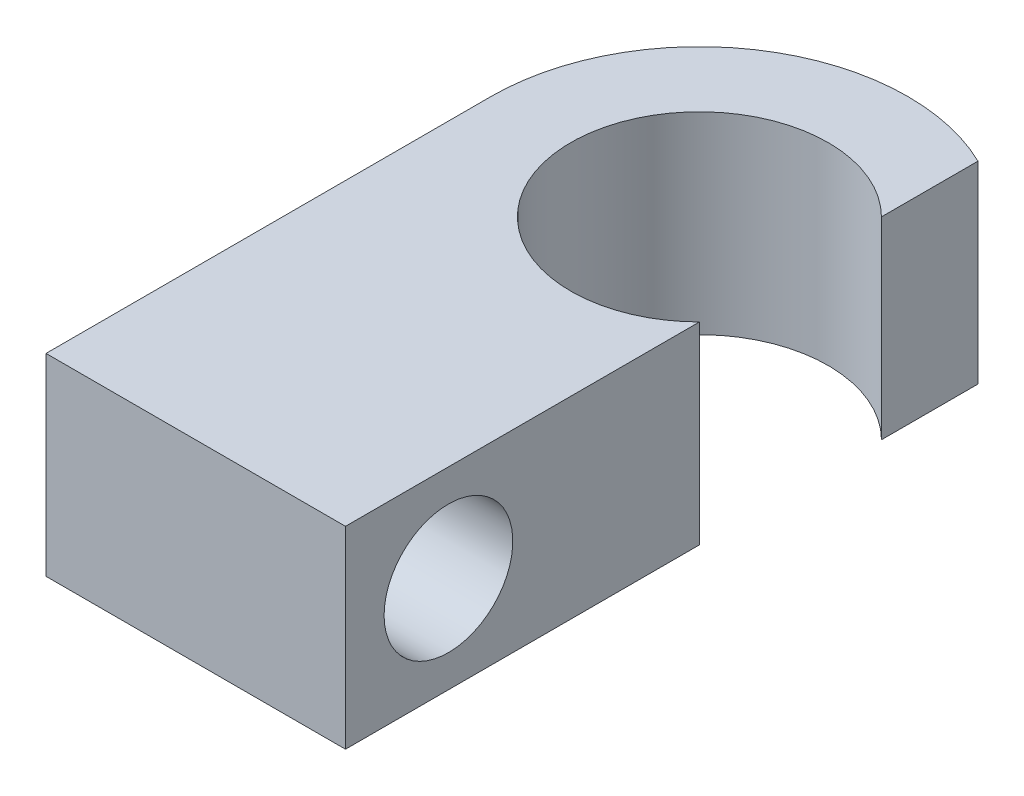
ISO-10303-21;
HEADER;
FILE_DESCRIPTION(('STEP AP214'),'2;1');
FILE_NAME('part.step','',(''),(''),'','','');
FILE_SCHEMA(('AUTOMOTIVE_DESIGN { 1 0 10303 214 1 1 1 1 }'));
ENDSEC;
DATA;
#1=APPLICATION_CONTEXT('core data for automotive mechanical design processes');
#2=APPLICATION_PROTOCOL_DEFINITION('international standard','automotive_design',2000,#1);
#3=PRODUCT_CONTEXT('',#1,'mechanical');
#4=PRODUCT('Part','Part','',(#3));
#5=PRODUCT_RELATED_PRODUCT_CATEGORY('part','',(#4));
#6=PRODUCT_DEFINITION_FORMATION('','',#4);
#7=PRODUCT_DEFINITION_CONTEXT('part definition',#1,'design');
#8=PRODUCT_DEFINITION('design','',#6,#7);
#9=PRODUCT_DEFINITION_SHAPE('','',#8);
#10=(LENGTH_UNIT() NAMED_UNIT(*) SI_UNIT(.MILLI.,.METRE.));
#11=(NAMED_UNIT(*) PLANE_ANGLE_UNIT() SI_UNIT($,.RADIAN.));
#12=(NAMED_UNIT(*) SI_UNIT($,.STERADIAN.) SOLID_ANGLE_UNIT());
#13=UNCERTAINTY_MEASURE_WITH_UNIT(LENGTH_MEASURE(1.E-05),#10,'distance_accuracy_value','');
#14=(GEOMETRIC_REPRESENTATION_CONTEXT(3) GLOBAL_UNCERTAINTY_ASSIGNED_CONTEXT((#13)) GLOBAL_UNIT_ASSIGNED_CONTEXT((#10,
#11,#12)) REPRESENTATION_CONTEXT('',''));
#15=CARTESIAN_POINT('',(0.,0.,0.));
#16=DIRECTION('',(0.,0.,1.));
#17=DIRECTION('',(1.,0.,0.));
#18=AXIS2_PLACEMENT_3D('',#15,#16,#17);
#19=CARTESIAN_POINT('',(0.,9.525,0.));
#20=DIRECTION('',(0.,-1.,0.));
#21=DIRECTION('',(0.,0.,-1.));
#22=AXIS2_PLACEMENT_3D('',#19,#20,#21);
#23=CYLINDRICAL_SURFACE('',#22,10.2845698026992);
#24=DIRECTION('',(0.,1.,0.));
#25=VECTOR('',#24,1.);
#26=CARTESIAN_POINT('',(-10.2845698026992,0.,0.));
#27=LINE('',#26,#25);
#28=CARTESIAN_POINT('',(-10.2845698026992,0.,0.));
#29=VERTEX_POINT('',#28);
#30=CARTESIAN_POINT('',(-10.2845698026992,9.525,0.));
#31=VERTEX_POINT('',#30);
#32=EDGE_CURVE('E45',#29,#31,#27,.T.);
#33=ORIENTED_EDGE('',*,*,#32,.T.);
#34=CARTESIAN_POINT('',(0.,9.525,0.));
#35=DIRECTION('',(0.,1.,0.));
#36=DIRECTION('',(0.,0.,1.));
#37=AXIS2_PLACEMENT_3D('',#34,#35,#36);
#38=CIRCLE('',#37,10.2845698026992);
#39=CARTESIAN_POINT('',(4.49012806053457,9.525,-9.25262806053458));
#40=VERTEX_POINT('',#39);
#41=EDGE_CURVE('E116',#40,#31,#38,.T.);
#42=ORIENTED_EDGE('',*,*,#41,.F.);
#43=DIRECTION('',(0.,-1.,0.));
#44=VECTOR('',#43,1.);
#45=CARTESIAN_POINT('',(4.49012806053457,9.525,-9.25262806053458));
#46=LINE('',#45,#44);
#47=CARTESIAN_POINT('',(4.49012806053457,0.,-9.25262806053458));
#48=VERTEX_POINT('',#47);
#49=EDGE_CURVE('E125',#40,#48,#46,.T.);
#50=ORIENTED_EDGE('',*,*,#49,.T.);
#51=CARTESIAN_POINT('',(0.,0.,0.));
#52=DIRECTION('',(0.,1.,0.));
#53=DIRECTION('',(0.,0.,1.));
#54=AXIS2_PLACEMENT_3D('',#51,#52,#53);
#55=CIRCLE('',#54,10.2845698026992);
#56=EDGE_CURVE('E50',#48,#29,#55,.T.);
#57=ORIENTED_EDGE('',*,*,#56,.T.);
#58=EDGE_LOOP('',(#33,#42,#50,#57));
#59=FACE_BOUND('',#58,.T.);
#60=ADVANCED_FACE('F31',(#59),#23,.T.);
#61=CARTESIAN_POINT('',(4.49012806053457,9.525,4.49012806053458));
#62=DIRECTION('',(-1.,0.,0.));
#63=DIRECTION('',(0.,0.,1.));
#64=AXIS2_PLACEMENT_3D('',#61,#62,#63);
#65=PLANE('',#64);
#66=CARTESIAN_POINT('',(4.49012806053458,4.7625,16.8726280605346));
#67=DIRECTION('',(-1.,0.,0.));
#68=DIRECTION('',(0.,0.,1.));
#69=AXIS2_PLACEMENT_3D('',#66,#67,#68);
#70=CIRCLE('',#69,3.175);
#71=CARTESIAN_POINT('',(4.49012806053458,4.7625,20.0476280605346));
#72=VERTEX_POINT('',#71);
#73=EDGE_CURVE('E112',#72,#72,#70,.T.);
#74=ORIENTED_EDGE('',*,*,#73,.T.);
#75=EDGE_LOOP('',(#74));
#76=FACE_BOUND('',#75,.T.);
#77=DIRECTION('',(0.,0.,-1.));
#78=VECTOR('',#77,1.);
#79=CARTESIAN_POINT('',(4.49012806053457,0.,4.49012806053458));
#80=LINE('',#79,#78);
#81=CARTESIAN_POINT('',(4.49012806053457,0.,21.9526280605346));
#82=VERTEX_POINT('',#81);
#83=CARTESIAN_POINT('',(4.49012806053457,0.,4.49012806053458));
#84=VERTEX_POINT('',#83);
#85=EDGE_CURVE('E101',#82,#84,#80,.T.);
#86=ORIENTED_EDGE('',*,*,#85,.T.);
#87=DIRECTION('',(0.,-1.,0.));
#88=VECTOR('',#87,1.);
#89=CARTESIAN_POINT('',(4.49012806053457,9.525,4.49012806053458));
#90=LINE('',#89,#88);
#91=CARTESIAN_POINT('',(4.49012806053457,9.525,4.49012806053458));
#92=VERTEX_POINT('',#91);
#93=EDGE_CURVE('E11',#92,#84,#90,.T.);
#94=ORIENTED_EDGE('',*,*,#93,.F.);
#95=DIRECTION('',(0.,0.,-1.));
#96=VECTOR('',#95,1.);
#97=CARTESIAN_POINT('',(4.49012806053457,9.525,4.49012806053458));
#98=LINE('',#97,#96);
#99=CARTESIAN_POINT('',(4.49012806053457,9.525,21.9526280605346));
#100=VERTEX_POINT('',#99);
#101=EDGE_CURVE('E118',#100,#92,#98,.T.);
#102=ORIENTED_EDGE('',*,*,#101,.F.);
#103=DIRECTION('',(0.,1.,0.));
#104=VECTOR('',#103,1.);
#105=CARTESIAN_POINT('',(4.49012806053457,0.,21.9526280605346));
#106=LINE('',#105,#104);
#107=EDGE_CURVE('E94',#82,#100,#106,.T.);
#108=ORIENTED_EDGE('',*,*,#107,.F.);
#109=EDGE_LOOP('',(#86,#94,#102,#108));
#110=FACE_BOUND('',#109,.T.);
#111=ADVANCED_FACE('F143',(#76,#110),#65,.F.);
#112=CARTESIAN_POINT('',(0.,9.525,0.));
#113=DIRECTION('',(0.,-1.,0.));
#114=DIRECTION('',(0.,0.,-1.));
#115=AXIS2_PLACEMENT_3D('',#112,#113,#114);
#116=CYLINDRICAL_SURFACE('',#115,6.35);
#117=CARTESIAN_POINT('',(0.,0.,0.));
#118=DIRECTION('',(0.,-1.,0.));
#119=DIRECTION('',(0.,0.,1.));
#120=AXIS2_PLACEMENT_3D('',#117,#118,#119);
#121=CIRCLE('',#120,6.35);
#122=CARTESIAN_POINT('',(4.49012806053457,0.,-4.49012806053458));
#123=VERTEX_POINT('',#122);
#124=EDGE_CURVE('E128',#84,#123,#121,.T.);
#125=ORIENTED_EDGE('',*,*,#124,.T.);
#126=DIRECTION('',(0.,-1.,0.));
#127=VECTOR('',#126,1.);
#128=CARTESIAN_POINT('',(4.49012806053457,9.525,-4.49012806053458));
#129=LINE('',#128,#127);
#130=CARTESIAN_POINT('',(4.49012806053457,9.525,-4.49012806053458));
#131=VERTEX_POINT('',#130);
#132=EDGE_CURVE('E38',#131,#123,#129,.T.);
#133=ORIENTED_EDGE('',*,*,#132,.F.);
#134=CARTESIAN_POINT('',(0.,9.525,0.));
#135=DIRECTION('',(0.,-1.,0.));
#136=DIRECTION('',(0.,0.,1.));
#137=AXIS2_PLACEMENT_3D('',#134,#135,#136);
#138=CIRCLE('',#137,6.35);
#139=EDGE_CURVE('E121',#92,#131,#138,.T.);
#140=ORIENTED_EDGE('',*,*,#139,.F.);
#141=ORIENTED_EDGE('',*,*,#93,.T.);
#142=EDGE_LOOP('',(#125,#133,#140,#141));
#143=FACE_BOUND('',#142,.T.);
#144=ADVANCED_FACE('F140',(#143),#116,.F.);
#145=CARTESIAN_POINT('',(4.49012806053457,9.525,-4.49012806053458));
#146=DIRECTION('',(-1.,0.,0.));
#147=DIRECTION('',(0.,0.,1.));
#148=AXIS2_PLACEMENT_3D('',#145,#146,#147);
#149=PLANE('',#148);
#150=DIRECTION('',(0.,0.,-1.));
#151=VECTOR('',#150,1.);
#152=CARTESIAN_POINT('',(4.49012806053457,0.,-4.49012806053458));
#153=LINE('',#152,#151);
#154=EDGE_CURVE('E119',#123,#48,#153,.T.);
#155=ORIENTED_EDGE('',*,*,#154,.T.);
#156=ORIENTED_EDGE('',*,*,#49,.F.);
#157=DIRECTION('',(0.,0.,-1.));
#158=VECTOR('',#157,1.);
#159=CARTESIAN_POINT('',(4.49012806053457,9.525,-4.49012806053458));
#160=LINE('',#159,#158);
#161=EDGE_CURVE('E123',#131,#40,#160,.T.);
#162=ORIENTED_EDGE('',*,*,#161,.F.);
#163=ORIENTED_EDGE('',*,*,#132,.T.);
#164=EDGE_LOOP('',(#155,#156,#162,#163));
#165=FACE_BOUND('',#164,.T.);
#166=ADVANCED_FACE('F136',(#165),#149,.F.);
#167=CARTESIAN_POINT('',(0.,9.525,0.));
#168=DIRECTION('',(0.,1.,0.));
#169=DIRECTION('',(0.,0.,1.));
#170=AXIS2_PLACEMENT_3D('',#167,#168,#169);
#171=PLANE('',#170);
#172=ORIENTED_EDGE('',*,*,#41,.T.);
#173=DIRECTION('',(0.,0.,1.));
#174=VECTOR('',#173,1.);
#175=CARTESIAN_POINT('',(-10.2845698026992,9.525,0.));
#176=LINE('',#175,#174);
#177=CARTESIAN_POINT('',(-10.2845698026992,9.525,21.9526280605346));
#178=VERTEX_POINT('',#177);
#179=EDGE_CURVE('E106',#31,#178,#176,.T.);
#180=ORIENTED_EDGE('',*,*,#179,.T.);
#181=DIRECTION('',(1.,0.,0.));
#182=VECTOR('',#181,1.);
#183=CARTESIAN_POINT('',(-10.2845698026992,9.525,21.9526280605346));
#184=LINE('',#183,#182);
#185=EDGE_CURVE('E89',#178,#100,#184,.T.);
#186=ORIENTED_EDGE('',*,*,#185,.T.);
#187=ORIENTED_EDGE('',*,*,#101,.T.);
#188=ORIENTED_EDGE('',*,*,#139,.T.);
#189=ORIENTED_EDGE('',*,*,#161,.T.);
#190=EDGE_LOOP('',(#172,#180,#186,#187,#188,#189));
#191=FACE_BOUND('',#190,.T.);
#192=ADVANCED_FACE('F145',(#191),#171,.T.);
#193=CARTESIAN_POINT('',(0.,0.,0.));
#194=DIRECTION('',(0.,1.,0.));
#195=DIRECTION('',(0.,0.,1.));
#196=AXIS2_PLACEMENT_3D('',#193,#194,#195);
#197=PLANE('',#196);
#198=ORIENTED_EDGE('',*,*,#56,.F.);
#199=ORIENTED_EDGE('',*,*,#154,.F.);
#200=ORIENTED_EDGE('',*,*,#124,.F.);
#201=ORIENTED_EDGE('',*,*,#85,.F.);
#202=DIRECTION('',(1.,0.,0.));
#203=VECTOR('',#202,1.);
#204=CARTESIAN_POINT('',(-10.2845698026992,0.,21.9526280605346));
#205=LINE('',#204,#203);
#206=CARTESIAN_POINT('',(-10.2845698026992,0.,21.9526280605346));
#207=VERTEX_POINT('',#206);
#208=EDGE_CURVE('E87',#207,#82,#205,.T.);
#209=ORIENTED_EDGE('',*,*,#208,.F.);
#210=DIRECTION('',(0.,0.,1.));
#211=VECTOR('',#210,1.);
#212=CARTESIAN_POINT('',(-10.2845698026992,0.,0.));
#213=LINE('',#212,#211);
#214=EDGE_CURVE('E99',#29,#207,#213,.T.);
#215=ORIENTED_EDGE('',*,*,#214,.F.);
#216=EDGE_LOOP('',(#198,#199,#200,#201,#209,#215));
#217=FACE_BOUND('',#216,.T.);
#218=ADVANCED_FACE('F98',(#217),#197,.F.);
#219=CARTESIAN_POINT('',(-10.2845698026992,0.,21.9526280605346));
#220=DIRECTION('',(0.,0.,1.));
#221=DIRECTION('',(1.,0.,0.));
#222=AXIS2_PLACEMENT_3D('',#219,#220,#221);
#223=PLANE('',#222);
#224=ORIENTED_EDGE('',*,*,#185,.F.);
#225=DIRECTION('',(0.,1.,0.));
#226=VECTOR('',#225,1.);
#227=CARTESIAN_POINT('',(-10.2845698026992,0.,21.9526280605346));
#228=LINE('',#227,#226);
#229=EDGE_CURVE('E83',#207,#178,#228,.T.);
#230=ORIENTED_EDGE('',*,*,#229,.F.);
#231=ORIENTED_EDGE('',*,*,#208,.T.);
#232=ORIENTED_EDGE('',*,*,#107,.T.);
#233=EDGE_LOOP('',(#224,#230,#231,#232));
#234=FACE_BOUND('',#233,.T.);
#235=ADVANCED_FACE('F85',(#234),#223,.T.);
#236=CARTESIAN_POINT('',(-10.2845698026992,0.,0.));
#237=DIRECTION('',(-1.,0.,0.));
#238=DIRECTION('',(0.,0.,1.));
#239=AXIS2_PLACEMENT_3D('',#236,#237,#238);
#240=PLANE('',#239);
#241=CARTESIAN_POINT('',(-10.2845698026992,4.7625,16.8726280605346));
#242=DIRECTION('',(-1.,0.,0.));
#243=DIRECTION('',(0.,0.,1.));
#244=AXIS2_PLACEMENT_3D('',#241,#242,#243);
#245=CIRCLE('',#244,3.175);
#246=CARTESIAN_POINT('',(-10.2845698026992,4.7625,20.0476280605346));
#247=VERTEX_POINT('',#246);
#248=EDGE_CURVE('E109',#247,#247,#245,.T.);
#249=ORIENTED_EDGE('',*,*,#248,.F.);
#250=EDGE_LOOP('',(#249));
#251=FACE_BOUND('',#250,.T.);
#252=ORIENTED_EDGE('',*,*,#179,.F.);
#253=ORIENTED_EDGE('',*,*,#32,.F.);
#254=ORIENTED_EDGE('',*,*,#214,.T.);
#255=ORIENTED_EDGE('',*,*,#229,.T.);
#256=EDGE_LOOP('',(#252,#253,#254,#255));
#257=FACE_BOUND('',#256,.T.);
#258=ADVANCED_FACE('F104',(#251,#257),#240,.T.);
#259=CARTESIAN_POINT('',(4.49012806053458,4.7625,16.8726280605346));
#260=DIRECTION('',(-1.,0.,0.));
#261=DIRECTION('',(0.,0.,1.));
#262=AXIS2_PLACEMENT_3D('',#259,#260,#261);
#263=CYLINDRICAL_SURFACE('',#262,3.175);
#264=ORIENTED_EDGE('',*,*,#73,.F.);
#265=EDGE_LOOP('',(#264));
#266=FACE_BOUND('',#265,.T.);
#267=ORIENTED_EDGE('',*,*,#248,.T.);
#268=EDGE_LOOP('',(#267));
#269=FACE_BOUND('',#268,.T.);
#270=ADVANCED_FACE('F165',(#266,#269),#263,.F.);
#271=CLOSED_SHELL('',(#60,#111,#144,#166,#192,#218,#235,#258,#270));
#272=MANIFOLD_SOLID_BREP('B2',#271);
#273=ADVANCED_BREP_SHAPE_REPRESENTATION('',(#18,#272),#14);
#274=SHAPE_DEFINITION_REPRESENTATION(#9,#273);
ENDSEC;
END-ISO-10303-21;
